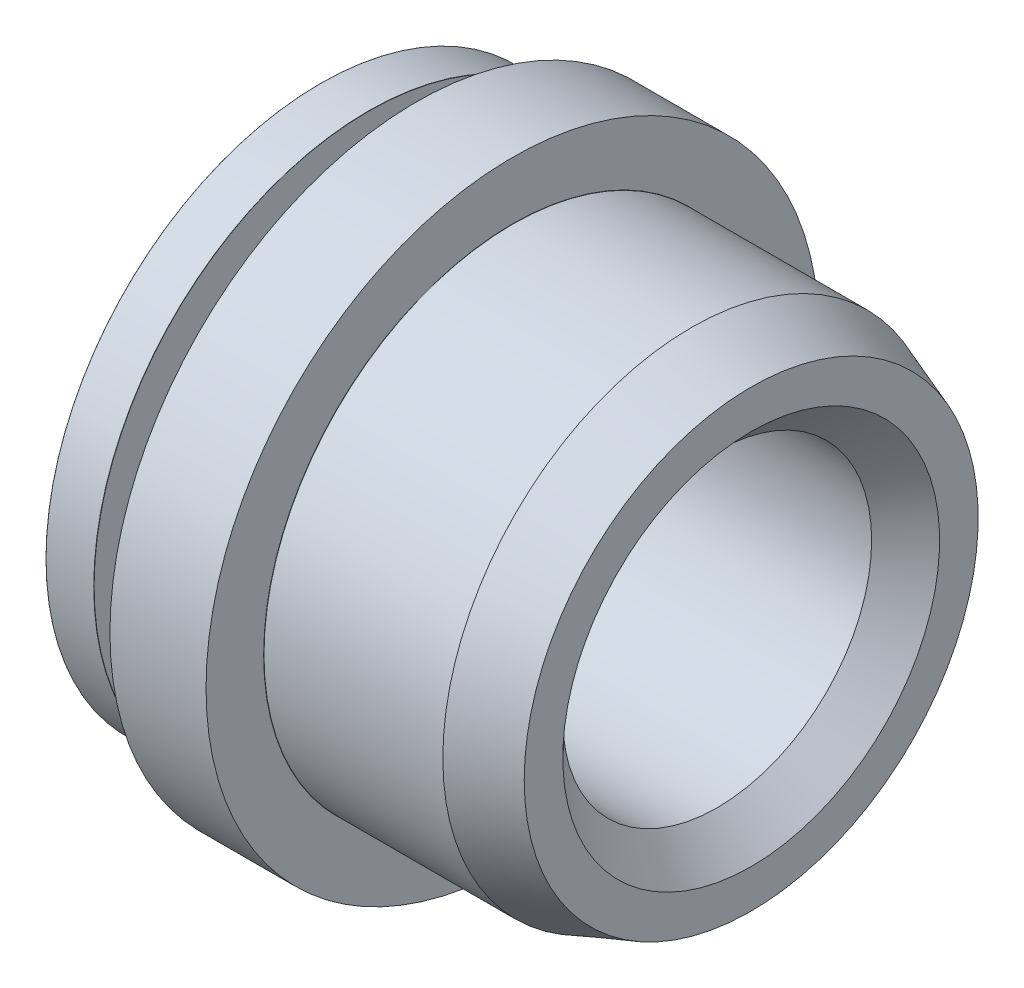
ISO-10303-21;
HEADER;
FILE_DESCRIPTION(('STEP AP214'),'2;1');
FILE_NAME('part.step','',(''),(''),'','','');
FILE_SCHEMA(('AUTOMOTIVE_DESIGN { 1 0 10303 214 1 1 1 1 }'));
ENDSEC;
DATA;
#1=APPLICATION_CONTEXT('core data for automotive mechanical design processes');
#2=APPLICATION_PROTOCOL_DEFINITION('international standard','automotive_design',2000,#1);
#3=PRODUCT_CONTEXT('',#1,'mechanical');
#4=PRODUCT('Part','Part','',(#3));
#5=PRODUCT_RELATED_PRODUCT_CATEGORY('part','',(#4));
#6=PRODUCT_DEFINITION_FORMATION('','',#4);
#7=PRODUCT_DEFINITION_CONTEXT('part definition',#1,'design');
#8=PRODUCT_DEFINITION('design','',#6,#7);
#9=PRODUCT_DEFINITION_SHAPE('','',#8);
#10=(LENGTH_UNIT() NAMED_UNIT(*) SI_UNIT(.MILLI.,.METRE.));
#11=(NAMED_UNIT(*) PLANE_ANGLE_UNIT() SI_UNIT($,.RADIAN.));
#12=(NAMED_UNIT(*) SI_UNIT($,.STERADIAN.) SOLID_ANGLE_UNIT());
#13=UNCERTAINTY_MEASURE_WITH_UNIT(LENGTH_MEASURE(1.E-05),#10,'distance_accuracy_value','');
#14=(GEOMETRIC_REPRESENTATION_CONTEXT(3) GLOBAL_UNCERTAINTY_ASSIGNED_CONTEXT((#13)) GLOBAL_UNIT_ASSIGNED_CONTEXT((#10,
#11,#12)) REPRESENTATION_CONTEXT('',''));
#15=CARTESIAN_POINT('',(0.,0.,0.));
#16=DIRECTION('',(0.,0.,1.));
#17=DIRECTION('',(1.,0.,0.));
#18=AXIS2_PLACEMENT_3D('',#15,#16,#17);
#19=CARTESIAN_POINT('',(0.7633,0.,0.));
#20=DIRECTION('',(1.,0.,0.));
#21=DIRECTION('',(0.,0.,-1.));
#22=AXIS2_PLACEMENT_3D('',#19,#20,#21);
#23=TOROIDAL_SURFACE('',#22,1.8042,0.00170000000000003);
#24=CARTESIAN_POINT('',(0.765,0.,0.));
#25=DIRECTION('',(-1.,0.,0.));
#26=DIRECTION('',(0.,0.,1.));
#27=AXIS2_PLACEMENT_3D('',#24,#25,#26);
#28=CIRCLE('',#27,1.8042);
#29=CARTESIAN_POINT('',(0.765000000000001,0.,-1.8042));
#30=VERTEX_POINT('',#29);
#31=CARTESIAN_POINT('',(0.765,0.,1.8042));
#32=VERTEX_POINT('',#31);
#33=EDGE_CURVE('E63',#30,#32,#28,.F.);
#34=ORIENTED_EDGE('',*,*,#33,.F.);
#35=CARTESIAN_POINT('',(0.765,0.,0.));
#36=DIRECTION('',(-1.,0.,0.));
#37=DIRECTION('',(0.,0.,-1.));
#38=AXIS2_PLACEMENT_3D('',#35,#36,#37);
#39=CIRCLE('',#38,1.8042);
#40=EDGE_CURVE('E66',#32,#30,#39,.F.);
#41=ORIENTED_EDGE('',*,*,#40,.F.);
#42=EDGE_LOOP('',(#34,#41));
#43=FACE_BOUND('',#42,.T.);
#44=CARTESIAN_POINT('',(0.7633,0.,0.));
#45=DIRECTION('',(1.,0.,0.));
#46=DIRECTION('',(0.,0.,-1.));
#47=AXIS2_PLACEMENT_3D('',#44,#45,#46);
#48=CIRCLE('',#47,1.8025);
#49=CARTESIAN_POINT('',(0.763300000000001,0.,-1.8025));
#50=VERTEX_POINT('',#49);
#51=EDGE_CURVE('E71',#50,#50,#48,.F.);
#52=ORIENTED_EDGE('',*,*,#51,.F.);
#53=EDGE_LOOP('',(#52));
#54=FACE_BOUND('',#53,.T.);
#55=ADVANCED_FACE('F16',(#43,#54),#23,.F.);
#56=CARTESIAN_POINT('',(0.57375,0.,0.));
#57=DIRECTION('',(1.,0.,0.));
#58=DIRECTION('',(0.,0.,-1.));
#59=AXIS2_PLACEMENT_3D('',#56,#57,#58);
#60=CYLINDRICAL_SURFACE('',#59,1.8025);
#61=ORIENTED_EDGE('',*,*,#51,.T.);
#62=EDGE_LOOP('',(#61));
#63=FACE_BOUND('',#62,.T.);
#64=CARTESIAN_POINT('',(0.3842,0.,0.));
#65=DIRECTION('',(1.,0.,0.));
#66=DIRECTION('',(0.,0.,-1.));
#67=AXIS2_PLACEMENT_3D('',#64,#65,#66);
#68=CIRCLE('',#67,1.8025);
#69=CARTESIAN_POINT('',(0.3842,0.,-1.8025));
#70=VERTEX_POINT('',#69);
#71=EDGE_CURVE('E76',#70,#70,#68,.T.);
#72=ORIENTED_EDGE('',*,*,#71,.T.);
#73=EDGE_LOOP('',(#72));
#74=FACE_BOUND('',#73,.T.);
#75=ADVANCED_FACE('F428',(#63,#74),#60,.T.);
#76=CARTESIAN_POINT('',(0.765,0.,1.9946));
#77=DIRECTION('',(-1.,0.,0.));
#78=DIRECTION('',(0.,0.,1.));
#79=AXIS2_PLACEMENT_3D('',#76,#77,#78);
#80=PLANE('',#79);
#81=ORIENTED_EDGE('',*,*,#40,.T.);
#82=ORIENTED_EDGE('',*,*,#33,.T.);
#83=EDGE_LOOP('',(#81,#82));
#84=FACE_BOUND('',#83,.T.);
#85=CARTESIAN_POINT('',(0.765,0.,0.));
#86=DIRECTION('',(-1.,0.,0.));
#87=DIRECTION('',(0.,0.,1.));
#88=AXIS2_PLACEMENT_3D('',#85,#86,#87);
#89=CIRCLE('',#88,2.44);
#90=CARTESIAN_POINT('',(0.765,0.,2.44));
#91=VERTEX_POINT('',#90);
#92=EDGE_CURVE('E105',#91,#91,#89,.F.);
#93=ORIENTED_EDGE('',*,*,#92,.F.);
#94=EDGE_LOOP('',(#93));
#95=FACE_BOUND('',#94,.T.);
#96=ADVANCED_FACE('F68',(#84,#95),#80,.T.);
#97=CARTESIAN_POINT('',(0.3842,0.,0.));
#98=DIRECTION('',(1.,0.,0.));
#99=DIRECTION('',(0.,0.,-1.));
#100=AXIS2_PLACEMENT_3D('',#97,#98,#99);
#101=TOROIDAL_SURFACE('',#100,1.8042,0.00170000000000048);
#102=ORIENTED_EDGE('',*,*,#71,.F.);
#103=EDGE_LOOP('',(#102));
#104=FACE_BOUND('',#103,.T.);
#105=CARTESIAN_POINT('',(0.3825,0.,0.));
#106=DIRECTION('',(1.,0.,0.));
#107=DIRECTION('',(0.,0.,1.));
#108=AXIS2_PLACEMENT_3D('',#105,#106,#107);
#109=CIRCLE('',#108,1.8042);
#110=CARTESIAN_POINT('',(0.3825,0.,-1.8042));
#111=VERTEX_POINT('',#110);
#112=CARTESIAN_POINT('',(0.3825,0.,1.8042));
#113=VERTEX_POINT('',#112);
#114=EDGE_CURVE('E108',#111,#113,#109,.F.);
#115=ORIENTED_EDGE('',*,*,#114,.F.);
#116=CARTESIAN_POINT('',(0.3825,0.,0.));
#117=DIRECTION('',(1.,0.,0.));
#118=DIRECTION('',(0.,0.,-1.));
#119=AXIS2_PLACEMENT_3D('',#116,#117,#118);
#120=CIRCLE('',#119,1.8042);
#121=EDGE_CURVE('E104',#113,#111,#120,.F.);
#122=ORIENTED_EDGE('',*,*,#121,.F.);
#123=EDGE_LOOP('',(#115,#122));
#124=FACE_BOUND('',#123,.T.);
#125=ADVANCED_FACE('F201',(#104,#124),#101,.F.);
#126=CARTESIAN_POINT('',(1.1475,0.,0.));
#127=DIRECTION('',(-1.,0.,0.));
#128=DIRECTION('',(0.,0.,1.));
#129=AXIS2_PLACEMENT_3D('',#126,#127,#128);
#130=CYLINDRICAL_SURFACE('',#129,2.44);
#131=CARTESIAN_POINT('',(1.53,0.,0.));
#132=DIRECTION('',(-1.,0.,0.));
#133=DIRECTION('',(0.,0.,1.));
#134=AXIS2_PLACEMENT_3D('',#131,#132,#133);
#135=CIRCLE('',#134,2.44);
#136=CARTESIAN_POINT('',(1.53,0.,2.44));
#137=VERTEX_POINT('',#136);
#138=EDGE_CURVE('E100',#137,#137,#135,.F.);
#139=ORIENTED_EDGE('',*,*,#138,.F.);
#140=EDGE_LOOP('',(#139));
#141=FACE_BOUND('',#140,.T.);
#142=ORIENTED_EDGE('',*,*,#92,.T.);
#143=EDGE_LOOP('',(#142));
#144=FACE_BOUND('',#143,.T.);
#145=ADVANCED_FACE('F212',(#141,#144),#130,.T.);
#146=CARTESIAN_POINT('',(0.3825,0.,1.99375));
#147=DIRECTION('',(1.,0.,0.));
#148=DIRECTION('',(0.,0.,-1.));
#149=AXIS2_PLACEMENT_3D('',#146,#147,#148);
#150=PLANE('',#149);
#151=CARTESIAN_POINT('',(0.3825,0.,0.));
#152=DIRECTION('',(-1.,0.,0.));
#153=DIRECTION('',(0.,0.,-1.));
#154=AXIS2_PLACEMENT_3D('',#151,#152,#153);
#155=CIRCLE('',#154,2.1833);
#156=CARTESIAN_POINT('',(0.3825,0.,-2.1833));
#157=VERTEX_POINT('',#156);
#158=CARTESIAN_POINT('',(0.3825,0.,2.1833));
#159=VERTEX_POINT('',#158);
#160=EDGE_CURVE('E103',#157,#159,#155,.T.);
#161=ORIENTED_EDGE('',*,*,#160,.F.);
#162=CARTESIAN_POINT('',(0.3825,0.,0.));
#163=DIRECTION('',(-1.,0.,0.));
#164=DIRECTION('',(0.,0.,1.));
#165=AXIS2_PLACEMENT_3D('',#162,#163,#164);
#166=CIRCLE('',#165,2.1833);
#167=EDGE_CURVE('E263',#159,#157,#166,.T.);
#168=ORIENTED_EDGE('',*,*,#167,.F.);
#169=EDGE_LOOP('',(#161,#168));
#170=FACE_BOUND('',#169,.T.);
#171=ORIENTED_EDGE('',*,*,#114,.T.);
#172=ORIENTED_EDGE('',*,*,#121,.T.);
#173=EDGE_LOOP('',(#171,#172));
#174=FACE_BOUND('',#173,.T.);
#175=ADVANCED_FACE('F232',(#170,#174),#150,.T.);
#176=CARTESIAN_POINT('',(1.53,0.,1.0925));
#177=DIRECTION('',(1.,0.,0.));
#178=DIRECTION('',(0.,0.,-1.));
#179=AXIS2_PLACEMENT_3D('',#176,#177,#178);
#180=PLANE('',#179);
#181=CARTESIAN_POINT('',(1.53,0.,0.));
#182=DIRECTION('',(1.,0.,0.));
#183=DIRECTION('',(0.,0.,1.));
#184=AXIS2_PLACEMENT_3D('',#181,#182,#183);
#185=CIRCLE('',#184,1.9817);
#186=CARTESIAN_POINT('',(1.53,0.,-1.9817));
#187=VERTEX_POINT('',#186);
#188=CARTESIAN_POINT('',(1.53,0.,1.9817));
#189=VERTEX_POINT('',#188);
#190=EDGE_CURVE('E271',#187,#189,#185,.F.);
#191=ORIENTED_EDGE('',*,*,#190,.T.);
#192=CARTESIAN_POINT('',(1.53,0.,0.));
#193=DIRECTION('',(1.,0.,0.));
#194=DIRECTION('',(0.,0.,-1.));
#195=AXIS2_PLACEMENT_3D('',#192,#193,#194);
#196=CIRCLE('',#195,1.9817);
#197=EDGE_CURVE('E273',#189,#187,#196,.F.);
#198=ORIENTED_EDGE('',*,*,#197,.T.);
#199=EDGE_LOOP('',(#191,#198));
#200=FACE_BOUND('',#199,.T.);
#201=ORIENTED_EDGE('',*,*,#138,.T.);
#202=EDGE_LOOP('',(#201));
#203=FACE_BOUND('',#202,.T.);
#204=ADVANCED_FACE('F244',(#200,#203),#180,.T.);
#205=CARTESIAN_POINT('',(0.3808,0.,0.));
#206=DIRECTION('',(1.,0.,0.));
#207=DIRECTION('',(0.,0.,-1.));
#208=AXIS2_PLACEMENT_3D('',#205,#206,#207);
#209=TOROIDAL_SURFACE('',#208,2.1833,0.00169999999999959);
#210=CARTESIAN_POINT('',(0.380800000000001,0.,0.));
#211=DIRECTION('',(1.,0.,0.));
#212=DIRECTION('',(0.,0.,-1.));
#213=AXIS2_PLACEMENT_3D('',#210,#211,#212);
#214=CIRCLE('',#213,2.185);
#215=CARTESIAN_POINT('',(0.380800000000001,0.,-2.185));
#216=VERTEX_POINT('',#215);
#217=EDGE_CURVE('E277',#216,#216,#214,.F.);
#218=ORIENTED_EDGE('',*,*,#217,.F.);
#219=EDGE_LOOP('',(#218));
#220=FACE_BOUND('',#219,.T.);
#221=ORIENTED_EDGE('',*,*,#167,.T.);
#222=ORIENTED_EDGE('',*,*,#160,.T.);
#223=EDGE_LOOP('',(#221,#222));
#224=FACE_BOUND('',#223,.T.);
#225=ADVANCED_FACE('F163',(#220,#224),#209,.T.);
#226=CARTESIAN_POINT('',(1.5317,0.,0.));
#227=DIRECTION('',(1.,0.,0.));
#228=DIRECTION('',(0.,0.,-1.));
#229=AXIS2_PLACEMENT_3D('',#226,#227,#228);
#230=TOROIDAL_SURFACE('',#229,1.9817,0.00170000000000003);
#231=CARTESIAN_POINT('',(1.5317,0.,0.));
#232=DIRECTION('',(1.,0.,0.));
#233=DIRECTION('',(0.,0.,-1.));
#234=AXIS2_PLACEMENT_3D('',#231,#232,#233);
#235=CIRCLE('',#234,1.98);
#236=CARTESIAN_POINT('',(1.5317,0.,-1.98));
#237=VERTEX_POINT('',#236);
#238=EDGE_CURVE('E153',#237,#237,#235,.T.);
#239=ORIENTED_EDGE('',*,*,#238,.F.);
#240=EDGE_LOOP('',(#239));
#241=FACE_BOUND('',#240,.T.);
#242=ORIENTED_EDGE('',*,*,#190,.F.);
#243=ORIENTED_EDGE('',*,*,#197,.F.);
#244=EDGE_LOOP('',(#242,#243));
#245=FACE_BOUND('',#244,.T.);
#246=ADVANCED_FACE('F158',(#241,#245),#230,.F.);
#247=CARTESIAN_POINT('',(0.19125,0.,0.));
#248=DIRECTION('',(1.,0.,0.));
#249=DIRECTION('',(0.,0.,-1.));
#250=AXIS2_PLACEMENT_3D('',#247,#248,#249);
#251=CYLINDRICAL_SURFACE('',#250,2.185);
#252=ORIENTED_EDGE('',*,*,#217,.T.);
#253=EDGE_LOOP('',(#252));
#254=FACE_BOUND('',#253,.T.);
#255=CARTESIAN_POINT('',(0.0017000000000007,0.,0.));
#256=DIRECTION('',(1.,0.,0.));
#257=DIRECTION('',(0.,0.,-1.));
#258=AXIS2_PLACEMENT_3D('',#255,#256,#257);
#259=CIRCLE('',#258,2.185);
#260=CARTESIAN_POINT('',(0.00170000000000119,0.,-2.185));
#261=VERTEX_POINT('',#260);
#262=EDGE_CURVE('E150',#261,#261,#259,.F.);
#263=ORIENTED_EDGE('',*,*,#262,.F.);
#264=EDGE_LOOP('',(#263));
#265=FACE_BOUND('',#264,.T.);
#266=ADVANCED_FACE('F162',(#254,#265),#251,.T.);
#267=CARTESIAN_POINT('',(2.24335,0.,0.));
#268=DIRECTION('',(1.,0.,0.));
#269=DIRECTION('',(0.,0.,-1.));
#270=AXIS2_PLACEMENT_3D('',#267,#268,#269);
#271=CYLINDRICAL_SURFACE('',#270,1.98);
#272=CARTESIAN_POINT('',(2.95499999998583,0.,0.));
#273=DIRECTION('',(-1.,0.,0.));
#274=DIRECTION('',(0.,0.,1.));
#275=AXIS2_PLACEMENT_3D('',#272,#273,#274);
#276=CIRCLE('',#275,1.98000000003162);
#277=CARTESIAN_POINT('',(2.95499999998583,-1.87083345624473E-13,1.98000000003162));
#278=VERTEX_POINT('',#277);
#279=EDGE_CURVE('E142',#278,#278,#276,.F.);
#280=ORIENTED_EDGE('',*,*,#279,.F.);
#281=EDGE_LOOP('',(#280));
#282=FACE_BOUND('',#281,.T.);
#283=ORIENTED_EDGE('',*,*,#238,.T.);
#284=EDGE_LOOP('',(#283));
#285=FACE_BOUND('',#284,.T.);
#286=ADVANCED_FACE('F128',(#282,#285),#271,.T.);
#287=CARTESIAN_POINT('',(0.0017000000000007,0.,0.));
#288=DIRECTION('',(1.,0.,0.));
#289=DIRECTION('',(0.,0.,-1.));
#290=AXIS2_PLACEMENT_3D('',#287,#288,#289);
#291=TOROIDAL_SURFACE('',#290,2.1833,0.00170000000000048);
#292=CARTESIAN_POINT('',(0.,0.,0.));
#293=DIRECTION('',(1.,0.,0.));
#294=DIRECTION('',(0.,0.,1.));
#295=AXIS2_PLACEMENT_3D('',#292,#293,#294);
#296=CIRCLE('',#295,2.1833);
#297=CARTESIAN_POINT('',(0.,0.,-2.1833));
#298=VERTEX_POINT('',#297);
#299=CARTESIAN_POINT('',(0.,0.,2.1833));
#300=VERTEX_POINT('',#299);
#301=EDGE_CURVE('E36',#298,#300,#296,.F.);
#302=ORIENTED_EDGE('',*,*,#301,.F.);
#303=CARTESIAN_POINT('',(0.,0.,0.));
#304=DIRECTION('',(1.,0.,0.));
#305=DIRECTION('',(0.,0.,-1.));
#306=AXIS2_PLACEMENT_3D('',#303,#304,#305);
#307=CIRCLE('',#306,2.1833);
#308=EDGE_CURVE('E99',#300,#298,#307,.F.);
#309=ORIENTED_EDGE('',*,*,#308,.F.);
#310=EDGE_LOOP('',(#302,#309));
#311=FACE_BOUND('',#310,.T.);
#312=ORIENTED_EDGE('',*,*,#262,.T.);
#313=EDGE_LOOP('',(#312));
#314=FACE_BOUND('',#313,.T.);
#315=ADVANCED_FACE('F116',(#311,#314),#291,.T.);
#316=CARTESIAN_POINT('',(2.95499999998583,0.,0.));
#317=DIRECTION('',(-1.,0.,0.));
#318=DIRECTION('',(0.,0.,1.));
#319=AXIS2_PLACEMENT_3D('',#316,#317,#318);
#320=CONICAL_SURFACE('',#319,1.98000000003162,0.349065850414423);
#321=CARTESIAN_POINT('',(3.43000000003713,0.,0.));
#322=DIRECTION('',(-1.,0.,0.));
#323=DIRECTION('',(0.,0.,1.));
#324=AXIS2_PLACEMENT_3D('',#321,#322,#323);
#325=CIRCLE('',#324,1.80711413872814);
#326=CARTESIAN_POINT('',(3.43000000003713,0.,1.80711413872814));
#327=VERTEX_POINT('',#326);
#328=EDGE_CURVE('E96',#327,#327,#325,.F.);
#329=ORIENTED_EDGE('',*,*,#328,.F.);
#330=EDGE_LOOP('',(#329));
#331=FACE_BOUND('',#330,.T.);
#332=ORIENTED_EDGE('',*,*,#279,.T.);
#333=EDGE_LOOP('',(#332));
#334=FACE_BOUND('',#333,.T.);
#335=ADVANCED_FACE('F127',(#331,#334),#320,.T.);
#336=CARTESIAN_POINT('',(0.,0.,1.09165));
#337=DIRECTION('',(-1.,0.,0.));
#338=DIRECTION('',(0.,0.,1.));
#339=AXIS2_PLACEMENT_3D('',#336,#337,#338);
#340=PLANE('',#339);
#341=ORIENTED_EDGE('',*,*,#301,.T.);
#342=ORIENTED_EDGE('',*,*,#308,.T.);
#343=EDGE_LOOP('',(#341,#342));
#344=FACE_BOUND('',#343,.T.);
#345=CARTESIAN_POINT('',(0.,0.,0.));
#346=DIRECTION('',(-1.,0.,0.));
#347=DIRECTION('',(0.,-1.,0.));
#348=AXIS2_PLACEMENT_3D('',#345,#346,#347);
#349=CIRCLE('',#348,1.50000000002137);
#350=CARTESIAN_POINT('',(0.,-1.50000000002137,0.));
#351=VERTEX_POINT('',#350);
#352=EDGE_CURVE('E93',#351,#351,#349,.F.);
#353=ORIENTED_EDGE('',*,*,#352,.T.);
#354=EDGE_LOOP('',(#353));
#355=FACE_BOUND('',#354,.T.);
#356=ADVANCED_FACE('F329',(#344,#355),#340,.T.);
#357=CARTESIAN_POINT('',(3.43,0.,0.903557069361777));
#358=DIRECTION('',(1.,0.,0.));
#359=DIRECTION('',(0.,0.,-1.));
#360=AXIS2_PLACEMENT_3D('',#357,#358,#359);
#361=PLANE('',#360);
#362=ORIENTED_EDGE('',*,*,#328,.T.);
#363=EDGE_LOOP('',(#362));
#364=FACE_BOUND('',#363,.T.);
#365=CARTESIAN_POINT('',(3.43000000009397,0.,0.));
#366=DIRECTION('',(1.,0.,0.));
#367=DIRECTION('',(0.,1.,0.));
#368=AXIS2_PLACEMENT_3D('',#365,#366,#367);
#369=CIRCLE('',#368,1.50000000007822);
#370=CARTESIAN_POINT('',(3.43000000009397,1.50000000007822,0.));
#371=VERTEX_POINT('',#370);
#372=EDGE_CURVE('E90',#371,#371,#369,.F.);
#373=ORIENTED_EDGE('',*,*,#372,.T.);
#374=EDGE_LOOP('',(#373));
#375=FACE_BOUND('',#374,.T.);
#376=ADVANCED_FACE('F326',(#364,#375),#361,.T.);
#377=CARTESIAN_POINT('',(0.,0.,0.));
#378=DIRECTION('',(-1.,0.,0.));
#379=DIRECTION('',(0.,-1.,0.));
#380=AXIS2_PLACEMENT_3D('',#377,#378,#379);
#381=CONICAL_SURFACE('',#380,1.50000000002137,0.785398163397448);
#382=CARTESIAN_POINT('',(0.2705,0.,0.));
#383=DIRECTION('',(-1.,0.,0.));
#384=DIRECTION('',(0.,-1.,0.));
#385=AXIS2_PLACEMENT_3D('',#382,#383,#384);
#386=CIRCLE('',#385,1.2295);
#387=CARTESIAN_POINT('',(0.2705,-1.2295,0.));
#388=VERTEX_POINT('',#387);
#389=EDGE_CURVE('E28',#388,#388,#386,.F.);
#390=ORIENTED_EDGE('',*,*,#389,.T.);
#391=EDGE_LOOP('',(#390));
#392=FACE_BOUND('',#391,.T.);
#393=ORIENTED_EDGE('',*,*,#352,.F.);
#394=EDGE_LOOP('',(#393));
#395=FACE_BOUND('',#394,.T.);
#396=ADVANCED_FACE('F318',(#392,#395),#381,.F.);
#397=CARTESIAN_POINT('',(3.43000000009397,0.,0.));
#398=DIRECTION('',(1.,0.,0.));
#399=DIRECTION('',(0.,1.,0.));
#400=AXIS2_PLACEMENT_3D('',#397,#398,#399);
#401=CONICAL_SURFACE('',#400,1.50000000007822,0.785398163397448);
#402=ORIENTED_EDGE('',*,*,#372,.F.);
#403=EDGE_LOOP('',(#402));
#404=FACE_BOUND('',#403,.T.);
#405=CARTESIAN_POINT('',(3.1595,0.,0.));
#406=DIRECTION('',(-1.,0.,0.));
#407=DIRECTION('',(0.,-1.,0.));
#408=AXIS2_PLACEMENT_3D('',#405,#406,#407);
#409=CIRCLE('',#408,1.2295);
#410=CARTESIAN_POINT('',(3.1595,-1.2295,0.));
#411=VERTEX_POINT('',#410);
#412=EDGE_CURVE('E10',#411,#411,#409,.T.);
#413=ORIENTED_EDGE('',*,*,#412,.T.);
#414=EDGE_LOOP('',(#413));
#415=FACE_BOUND('',#414,.T.);
#416=ADVANCED_FACE('F312',(#404,#415),#401,.F.);
#417=CARTESIAN_POINT('',(1.715,0.,0.));
#418=DIRECTION('',(-1.,0.,0.));
#419=DIRECTION('',(0.,-1.,0.));
#420=AXIS2_PLACEMENT_3D('',#417,#418,#419);
#421=CYLINDRICAL_SURFACE('',#420,1.2295);
#422=ORIENTED_EDGE('',*,*,#412,.F.);
#423=EDGE_LOOP('',(#422));
#424=FACE_BOUND('',#423,.T.);
#425=ORIENTED_EDGE('',*,*,#389,.F.);
#426=EDGE_LOOP('',(#425));
#427=FACE_BOUND('',#426,.T.);
#428=ADVANCED_FACE('F310',(#424,#427),#421,.F.);
#429=CLOSED_SHELL('',(#55,#75,#96,#125,#145,#175,#204,#225,#246,#266,#286,#315,#335,#356,#376,
#396,#416,#428));
#430=MANIFOLD_SOLID_BREP('B1',#429);
#431=ADVANCED_BREP_SHAPE_REPRESENTATION('',(#18,#430),#14);
#432=SHAPE_DEFINITION_REPRESENTATION(#9,#431);
ENDSEC;
END-ISO-10303-21;
